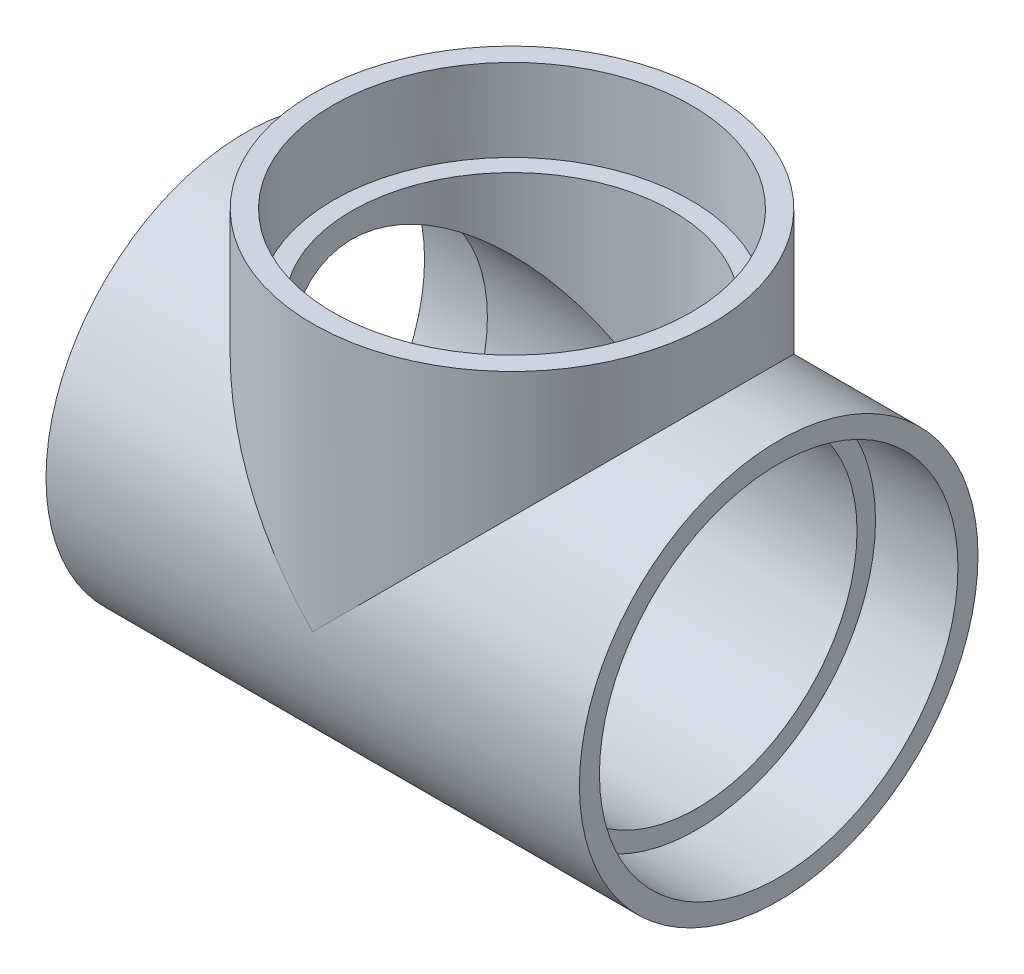
ISO-10303-21;
HEADER;
FILE_DESCRIPTION(('STEP AP214'),'2;1');
FILE_NAME('part.step','',(''),(''),'','','');
FILE_SCHEMA(('AUTOMOTIVE_DESIGN { 1 0 10303 214 1 1 1 1 }'));
ENDSEC;
DATA;
#1=APPLICATION_CONTEXT('core data for automotive mechanical design processes');
#2=APPLICATION_PROTOCOL_DEFINITION('international standard','automotive_design',2000,#1);
#3=PRODUCT_CONTEXT('',#1,'mechanical');
#4=PRODUCT('Part','Part','',(#3));
#5=PRODUCT_RELATED_PRODUCT_CATEGORY('part','',(#4));
#6=PRODUCT_DEFINITION_FORMATION('','',#4);
#7=PRODUCT_DEFINITION_CONTEXT('part definition',#1,'design');
#8=PRODUCT_DEFINITION('design','',#6,#7);
#9=PRODUCT_DEFINITION_SHAPE('','',#8);
#10=(LENGTH_UNIT() NAMED_UNIT(*) SI_UNIT(.MILLI.,.METRE.));
#11=(NAMED_UNIT(*) PLANE_ANGLE_UNIT() SI_UNIT($,.RADIAN.));
#12=(NAMED_UNIT(*) SI_UNIT($,.STERADIAN.) SOLID_ANGLE_UNIT());
#13=UNCERTAINTY_MEASURE_WITH_UNIT(LENGTH_MEASURE(1.E-05),#10,'distance_accuracy_value','');
#14=(GEOMETRIC_REPRESENTATION_CONTEXT(3) GLOBAL_UNCERTAINTY_ASSIGNED_CONTEXT((#13)) GLOBAL_UNIT_ASSIGNED_CONTEXT((#10,
#11,#12)) REPRESENTATION_CONTEXT('',''));
#15=CARTESIAN_POINT('',(0.,0.,0.));
#16=DIRECTION('',(0.,0.,1.));
#17=DIRECTION('',(1.,0.,0.));
#18=AXIS2_PLACEMENT_3D('',#15,#16,#17);
#19=CARTESIAN_POINT('',(58.9788,0.,0.));
#20=DIRECTION('',(-1.,0.,0.));
#21=DIRECTION('',(0.,0.,1.));
#22=AXIS2_PLACEMENT_3D('',#19,#20,#21);
#23=CYLINDRICAL_SURFACE('',#22,63.6016);
#24=CARTESIAN_POINT('',(-85.1154,0.,0.));
#25=DIRECTION('',(-1.,0.,0.));
#26=DIRECTION('',(0.,0.,1.));
#27=AXIS2_PLACEMENT_3D('',#24,#25,#26);
#28=CIRCLE('',#27,63.6016);
#29=CARTESIAN_POINT('',(-85.1154,0.,63.6016));
#30=VERTEX_POINT('',#29);
#31=EDGE_CURVE('E96',#30,#30,#28,.T.);
#32=ORIENTED_EDGE('',*,*,#31,.F.);
#33=EDGE_LOOP('',(#32));
#34=FACE_BOUND('',#33,.T.);
#35=CARTESIAN_POINT('',(0.,0.,0.));
#36=DIRECTION('',(-0.707106781186547,-0.707106781186547,0.));
#37=DIRECTION('',(0.707106781186547,-0.707106781186547,0.));
#38=AXIS2_PLACEMENT_3D('',#35,#36,#37);
#39=ELLIPSE('',#38,89.9462453086286,63.6016);
#40=CARTESIAN_POINT('',(0.,0.,63.6016));
#41=VERTEX_POINT('',#40);
#42=CARTESIAN_POINT('',(0.,0.,-63.6016));
#43=VERTEX_POINT('',#42);
#44=EDGE_CURVE('E88',#41,#43,#39,.T.);
#45=ORIENTED_EDGE('',*,*,#44,.T.);
#46=CARTESIAN_POINT('',(0.,0.,0.));
#47=DIRECTION('',(0.707106781186547,-0.707106781186547,0.));
#48=DIRECTION('',(-0.707106781186547,-0.707106781186547,0.));
#49=AXIS2_PLACEMENT_3D('',#46,#47,#48);
#50=ELLIPSE('',#49,89.9462453086286,63.6016);
#51=EDGE_CURVE('E56',#43,#41,#50,.T.);
#52=ORIENTED_EDGE('',*,*,#51,.T.);
#53=EDGE_LOOP('',(#45,#52));
#54=FACE_BOUND('',#53,.T.);
#55=CARTESIAN_POINT('',(85.1154,0.,0.));
#56=DIRECTION('',(1.,0.,0.));
#57=DIRECTION('',(0.,0.,-1.));
#58=AXIS2_PLACEMENT_3D('',#55,#56,#57);
#59=CIRCLE('',#58,63.6016);
#60=CARTESIAN_POINT('',(85.1154,0.,-63.6016));
#61=VERTEX_POINT('',#60);
#62=EDGE_CURVE('E97',#61,#61,#59,.T.);
#63=ORIENTED_EDGE('',*,*,#62,.F.);
#64=EDGE_LOOP('',(#63));
#65=FACE_BOUND('',#64,.T.);
#66=ADVANCED_FACE('F35',(#34,#54,#65),#23,.T.);
#67=CARTESIAN_POINT('',(110.5154,0.,0.));
#68=DIRECTION('',(1.,0.,0.));
#69=DIRECTION('',(0.,0.,-1.));
#70=AXIS2_PLACEMENT_3D('',#67,#68,#69);
#71=CONICAL_SURFACE('',#70,57.3786,0.00665342572354815);
#72=CARTESIAN_POINT('',(58.9788,0.,0.));
#73=DIRECTION('',(1.,0.,0.));
#74=DIRECTION('',(0.,0.,-1.));
#75=AXIS2_PLACEMENT_3D('',#72,#73,#74);
#76=CIRCLE('',#75,57.0357);
#77=CARTESIAN_POINT('',(58.9788,0.,-57.0357));
#78=VERTEX_POINT('',#77);
#79=EDGE_CURVE('E64',#78,#78,#76,.F.);
#80=ORIENTED_EDGE('',*,*,#79,.T.);
#81=EDGE_LOOP('',(#80));
#82=FACE_BOUND('',#81,.T.);
#83=CARTESIAN_POINT('',(85.1154,0.,0.));
#84=DIRECTION('',(1.,0.,0.));
#85=DIRECTION('',(0.,0.,-1.));
#86=AXIS2_PLACEMENT_3D('',#83,#84,#85);
#87=CIRCLE('',#86,57.2096004928536);
#88=CARTESIAN_POINT('',(85.1154,0.,-57.2096004928536));
#89=VERTEX_POINT('',#88);
#90=EDGE_CURVE('E39',#89,#89,#87,.T.);
#91=ORIENTED_EDGE('',*,*,#90,.T.);
#92=EDGE_LOOP('',(#91));
#93=FACE_BOUND('',#92,.T.);
#94=ADVANCED_FACE('F127',(#82,#93),#71,.F.);
#95=CARTESIAN_POINT('',(-58.9788,0.,0.));
#96=DIRECTION('',(-1.,0.,0.));
#97=DIRECTION('',(0.,0.,1.));
#98=AXIS2_PLACEMENT_3D('',#95,#96,#97);
#99=CONICAL_SURFACE('',#98,57.0357,0.00665342572354842);
#100=CARTESIAN_POINT('',(-58.9788,0.,0.));
#101=DIRECTION('',(-1.,0.,0.));
#102=DIRECTION('',(0.,0.,1.));
#103=AXIS2_PLACEMENT_3D('',#100,#101,#102);
#104=CIRCLE('',#103,57.0357);
#105=CARTESIAN_POINT('',(-58.9788,0.,57.0357));
#106=VERTEX_POINT('',#105);
#107=EDGE_CURVE('E80',#106,#106,#104,.T.);
#108=ORIENTED_EDGE('',*,*,#107,.F.);
#109=EDGE_LOOP('',(#108));
#110=FACE_BOUND('',#109,.T.);
#111=CARTESIAN_POINT('',(-85.1154,0.,0.));
#112=DIRECTION('',(-1.,0.,0.));
#113=DIRECTION('',(0.,0.,1.));
#114=AXIS2_PLACEMENT_3D('',#111,#112,#113);
#115=CIRCLE('',#114,57.2096004928536);
#116=CARTESIAN_POINT('',(-85.1154,0.,57.2096004928536));
#117=VERTEX_POINT('',#116);
#118=EDGE_CURVE('E94',#117,#117,#115,.T.);
#119=ORIENTED_EDGE('',*,*,#118,.T.);
#120=EDGE_LOOP('',(#119));
#121=FACE_BOUND('',#120,.T.);
#122=ADVANCED_FACE('F133',(#110,#121),#99,.F.);
#123=CARTESIAN_POINT('',(0.,110.5154,0.));
#124=DIRECTION('',(0.,1.,0.));
#125=DIRECTION('',(-1.,0.,0.));
#126=AXIS2_PLACEMENT_3D('',#123,#124,#125);
#127=CONICAL_SURFACE('',#126,57.3786,0.00665342572354841);
#128=CARTESIAN_POINT('',(0.,58.9788,0.));
#129=DIRECTION('',(0.,-1.,0.));
#130=DIRECTION('',(1.,0.,0.));
#131=AXIS2_PLACEMENT_3D('',#128,#129,#130);
#132=CIRCLE('',#131,57.0357);
#133=CARTESIAN_POINT('',(57.0357,58.9788,0.));
#134=VERTEX_POINT('',#133);
#135=EDGE_CURVE('E90',#134,#134,#132,.T.);
#136=ORIENTED_EDGE('',*,*,#135,.T.);
#137=EDGE_LOOP('',(#136));
#138=FACE_BOUND('',#137,.T.);
#139=CARTESIAN_POINT('',(0.,85.1154,0.));
#140=DIRECTION('',(0.,1.,0.));
#141=DIRECTION('',(-1.,0.,0.));
#142=AXIS2_PLACEMENT_3D('',#139,#140,#141);
#143=CIRCLE('',#142,57.2096004928536);
#144=CARTESIAN_POINT('',(-57.2096004928536,85.1154,0.));
#145=VERTEX_POINT('',#144);
#146=EDGE_CURVE('E111',#145,#145,#143,.T.);
#147=ORIENTED_EDGE('',*,*,#146,.T.);
#148=EDGE_LOOP('',(#147));
#149=FACE_BOUND('',#148,.T.);
#150=ADVANCED_FACE('F141',(#138,#149),#127,.F.);
#151=CARTESIAN_POINT('',(0.,0.,0.));
#152=DIRECTION('',(0.,-1.,0.));
#153=DIRECTION('',(1.,0.,0.));
#154=AXIS2_PLACEMENT_3D('',#151,#152,#153);
#155=CYLINDRICAL_SURFACE('',#154,63.6016);
#156=ORIENTED_EDGE('',*,*,#51,.F.);
#157=ORIENTED_EDGE('',*,*,#44,.F.);
#158=EDGE_LOOP('',(#156,#157));
#159=FACE_BOUND('',#158,.T.);
#160=CARTESIAN_POINT('',(0.,85.1154,0.));
#161=DIRECTION('',(0.,1.,0.));
#162=DIRECTION('',(-1.,0.,0.));
#163=AXIS2_PLACEMENT_3D('',#160,#161,#162);
#164=CIRCLE('',#163,63.6016);
#165=CARTESIAN_POINT('',(-63.6016,85.1154,0.));
#166=VERTEX_POINT('',#165);
#167=EDGE_CURVE('E101',#166,#166,#164,.T.);
#168=ORIENTED_EDGE('',*,*,#167,.F.);
#169=EDGE_LOOP('',(#168));
#170=FACE_BOUND('',#169,.T.);
#171=ADVANCED_FACE('F37',(#159,#170),#155,.T.);
#172=CARTESIAN_POINT('',(-58.9788,0.,0.));
#173=DIRECTION('',(1.,0.,0.));
#174=DIRECTION('',(0.,0.,-1.));
#175=AXIS2_PLACEMENT_3D('',#172,#173,#174);
#176=PLANE('',#175);
#177=ORIENTED_EDGE('',*,*,#107,.T.);
#178=EDGE_LOOP('',(#177));
#179=FACE_BOUND('',#178,.T.);
#180=CARTESIAN_POINT('',(-58.9788,0.,0.));
#181=DIRECTION('',(1.,0.,0.));
#182=DIRECTION('',(0.,0.,-1.));
#183=AXIS2_PLACEMENT_3D('',#180,#181,#182);
#184=CIRCLE('',#183,51.1302);
#185=CARTESIAN_POINT('',(-58.9788,0.,-51.1302));
#186=VERTEX_POINT('',#185);
#187=EDGE_CURVE('E77',#186,#186,#184,.T.);
#188=ORIENTED_EDGE('',*,*,#187,.T.);
#189=EDGE_LOOP('',(#188));
#190=FACE_BOUND('',#189,.T.);
#191=ADVANCED_FACE('F139',(#179,#190),#176,.F.);
#192=CARTESIAN_POINT('',(58.9788,0.,0.));
#193=DIRECTION('',(1.,0.,0.));
#194=DIRECTION('',(0.,0.,-1.));
#195=AXIS2_PLACEMENT_3D('',#192,#193,#194);
#196=PLANE('',#195);
#197=CARTESIAN_POINT('',(58.9788,0.,0.));
#198=DIRECTION('',(1.,0.,0.));
#199=DIRECTION('',(0.,0.,-1.));
#200=AXIS2_PLACEMENT_3D('',#197,#198,#199);
#201=CIRCLE('',#200,51.1302);
#202=CARTESIAN_POINT('',(58.9788,0.,-51.1302));
#203=VERTEX_POINT('',#202);
#204=EDGE_CURVE('E74',#203,#203,#201,.T.);
#205=ORIENTED_EDGE('',*,*,#204,.F.);
#206=EDGE_LOOP('',(#205));
#207=FACE_BOUND('',#206,.T.);
#208=ORIENTED_EDGE('',*,*,#79,.F.);
#209=EDGE_LOOP('',(#208));
#210=FACE_BOUND('',#209,.T.);
#211=ADVANCED_FACE('F157',(#207,#210),#196,.T.);
#212=CARTESIAN_POINT('',(0.,58.9788,0.));
#213=DIRECTION('',(0.,-1.,0.));
#214=DIRECTION('',(1.,0.,0.));
#215=AXIS2_PLACEMENT_3D('',#212,#213,#214);
#216=PLANE('',#215);
#217=CARTESIAN_POINT('',(0.,58.9788,0.));
#218=DIRECTION('',(0.,-1.,0.));
#219=DIRECTION('',(1.,0.,0.));
#220=AXIS2_PLACEMENT_3D('',#217,#218,#219);
#221=CIRCLE('',#220,51.1302);
#222=CARTESIAN_POINT('',(51.1302,58.9788,0.));
#223=VERTEX_POINT('',#222);
#224=EDGE_CURVE('E82',#223,#223,#221,.T.);
#225=ORIENTED_EDGE('',*,*,#224,.T.);
#226=EDGE_LOOP('',(#225));
#227=FACE_BOUND('',#226,.T.);
#228=ORIENTED_EDGE('',*,*,#135,.F.);
#229=EDGE_LOOP('',(#228));
#230=FACE_BOUND('',#229,.T.);
#231=ADVANCED_FACE('F69',(#227,#230),#216,.F.);
#232=CARTESIAN_POINT('',(110.5154,0.,0.));
#233=DIRECTION('',(1.,0.,0.));
#234=DIRECTION('',(0.,0.,-1.));
#235=AXIS2_PLACEMENT_3D('',#232,#233,#234);
#236=CYLINDRICAL_SURFACE('',#235,51.1302);
#237=CARTESIAN_POINT('',(0.,0.,0.));
#238=DIRECTION('',(0.707106781186547,-0.707106781186547,0.));
#239=DIRECTION('',(0.707106781186547,0.707106781186547,0.));
#240=AXIS2_PLACEMENT_3D('',#237,#238,#239);
#241=ELLIPSE('',#240,72.3090222868488,51.1302);
#242=CARTESIAN_POINT('',(0.,0.,-51.1302));
#243=VERTEX_POINT('',#242);
#244=CARTESIAN_POINT('',(0.,0.,51.1302));
#245=VERTEX_POINT('',#244);
#246=EDGE_CURVE('E11',#243,#245,#241,.T.);
#247=ORIENTED_EDGE('',*,*,#246,.F.);
#248=CARTESIAN_POINT('',(0.,0.,0.));
#249=DIRECTION('',(0.707106781186547,0.707106781186547,0.));
#250=DIRECTION('',(0.707106781186547,-0.707106781186547,0.));
#251=AXIS2_PLACEMENT_3D('',#248,#249,#250);
#252=ELLIPSE('',#251,72.3090222868488,51.1302);
#253=EDGE_CURVE('E44',#245,#243,#252,.F.);
#254=ORIENTED_EDGE('',*,*,#253,.F.);
#255=EDGE_LOOP('',(#247,#254));
#256=FACE_BOUND('',#255,.T.);
#257=ORIENTED_EDGE('',*,*,#204,.T.);
#258=EDGE_LOOP('',(#257));
#259=FACE_BOUND('',#258,.T.);
#260=ORIENTED_EDGE('',*,*,#187,.F.);
#261=EDGE_LOOP('',(#260));
#262=FACE_BOUND('',#261,.T.);
#263=ADVANCED_FACE('F66',(#256,#259,#262),#236,.F.);
#264=CARTESIAN_POINT('',(0.,0.,0.));
#265=DIRECTION('',(0.,-1.,0.));
#266=DIRECTION('',(1.,0.,0.));
#267=AXIS2_PLACEMENT_3D('',#264,#265,#266);
#268=CYLINDRICAL_SURFACE('',#267,51.1302);
#269=ORIENTED_EDGE('',*,*,#246,.T.);
#270=ORIENTED_EDGE('',*,*,#253,.T.);
#271=EDGE_LOOP('',(#269,#270));
#272=FACE_BOUND('',#271,.T.);
#273=ORIENTED_EDGE('',*,*,#224,.F.);
#274=EDGE_LOOP('',(#273));
#275=FACE_BOUND('',#274,.T.);
#276=ADVANCED_FACE('F61',(#272,#275),#268,.F.);
#277=CARTESIAN_POINT('',(0.,85.1154,0.));
#278=DIRECTION('',(0.,1.,0.));
#279=DIRECTION('',(-1.,0.,0.));
#280=AXIS2_PLACEMENT_3D('',#277,#278,#279);
#281=PLANE('',#280);
#282=ORIENTED_EDGE('',*,*,#146,.F.);
#283=EDGE_LOOP('',(#282));
#284=FACE_BOUND('',#283,.T.);
#285=ORIENTED_EDGE('',*,*,#167,.T.);
#286=EDGE_LOOP('',(#285));
#287=FACE_BOUND('',#286,.T.);
#288=ADVANCED_FACE('F118',(#284,#287),#281,.T.);
#289=CARTESIAN_POINT('',(-85.1154,0.,0.));
#290=DIRECTION('',(-1.,0.,0.));
#291=DIRECTION('',(0.,0.,1.));
#292=AXIS2_PLACEMENT_3D('',#289,#290,#291);
#293=PLANE('',#292);
#294=ORIENTED_EDGE('',*,*,#118,.F.);
#295=EDGE_LOOP('',(#294));
#296=FACE_BOUND('',#295,.T.);
#297=ORIENTED_EDGE('',*,*,#31,.T.);
#298=EDGE_LOOP('',(#297));
#299=FACE_BOUND('',#298,.T.);
#300=ADVANCED_FACE('F123',(#296,#299),#293,.T.);
#301=CARTESIAN_POINT('',(85.1154,0.,0.));
#302=DIRECTION('',(1.,0.,0.));
#303=DIRECTION('',(0.,0.,-1.));
#304=AXIS2_PLACEMENT_3D('',#301,#302,#303);
#305=PLANE('',#304);
#306=ORIENTED_EDGE('',*,*,#90,.F.);
#307=EDGE_LOOP('',(#306));
#308=FACE_BOUND('',#307,.T.);
#309=ORIENTED_EDGE('',*,*,#62,.T.);
#310=EDGE_LOOP('',(#309));
#311=FACE_BOUND('',#310,.T.);
#312=ADVANCED_FACE('F172',(#308,#311),#305,.T.);
#313=CLOSED_SHELL('',(#66,#94,#122,#150,#171,#191,#211,#231,#263,#276,#288,#300,#312));
#314=MANIFOLD_SOLID_BREP('B2',#313);
#315=ADVANCED_BREP_SHAPE_REPRESENTATION('',(#18,#314),#14);
#316=SHAPE_DEFINITION_REPRESENTATION(#9,#315);
ENDSEC;
END-ISO-10303-21;
